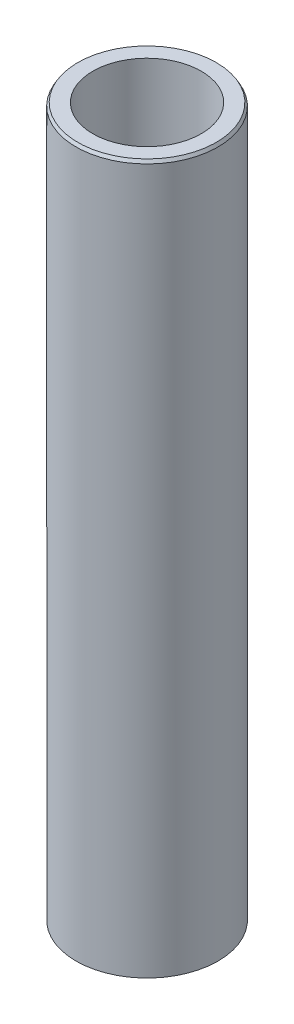
ISO-10303-21;
HEADER;
FILE_DESCRIPTION(('STEP AP214'),'2;1');
FILE_NAME('part.step','',(''),(''),'','','');
FILE_SCHEMA(('AUTOMOTIVE_DESIGN { 1 0 10303 214 1 1 1 1 }'));
ENDSEC;
DATA;
#1=APPLICATION_CONTEXT('core data for automotive mechanical design processes');
#2=APPLICATION_PROTOCOL_DEFINITION('international standard','automotive_design',2000,#1);
#3=PRODUCT_CONTEXT('',#1,'mechanical');
#4=PRODUCT('Part','Part','',(#3));
#5=PRODUCT_RELATED_PRODUCT_CATEGORY('part','',(#4));
#6=PRODUCT_DEFINITION_FORMATION('','',#4);
#7=PRODUCT_DEFINITION_CONTEXT('part definition',#1,'design');
#8=PRODUCT_DEFINITION('design','',#6,#7);
#9=PRODUCT_DEFINITION_SHAPE('','',#8);
#10=(LENGTH_UNIT() NAMED_UNIT(*) SI_UNIT(.MILLI.,.METRE.));
#11=(NAMED_UNIT(*) PLANE_ANGLE_UNIT() SI_UNIT($,.RADIAN.));
#12=(NAMED_UNIT(*) SI_UNIT($,.STERADIAN.) SOLID_ANGLE_UNIT());
#13=UNCERTAINTY_MEASURE_WITH_UNIT(LENGTH_MEASURE(1.E-05),#10,'distance_accuracy_value','');
#14=(GEOMETRIC_REPRESENTATION_CONTEXT(3) GLOBAL_UNCERTAINTY_ASSIGNED_CONTEXT((#13)) GLOBAL_UNIT_ASSIGNED_CONTEXT((#10,
#11,#12)) REPRESENTATION_CONTEXT('',''));
#15=CARTESIAN_POINT('',(0.,0.,0.));
#16=DIRECTION('',(0.,0.,1.));
#17=DIRECTION('',(1.,0.,0.));
#18=AXIS2_PLACEMENT_3D('',#15,#16,#17);
#19=CARTESIAN_POINT('',(0.,600.,0.));
#20=DIRECTION('',(0.,-1.,0.));
#21=DIRECTION('',(0.,0.,-1.));
#22=AXIS2_PLACEMENT_3D('',#19,#20,#21);
#23=CYLINDRICAL_SURFACE('',#22,60.);
#24=CARTESIAN_POINT('',(0.,597.395240626448,0.));
#25=DIRECTION('',(0.,1.,0.));
#26=DIRECTION('',(0.,0.,1.));
#27=AXIS2_PLACEMENT_3D('',#24,#25,#26);
#28=CIRCLE('',#27,60.);
#29=CARTESIAN_POINT('',(0.,597.395240626448,-60.));
#30=VERTEX_POINT('',#29);
#31=EDGE_CURVE('E50',#30,#30,#28,.F.);
#32=ORIENTED_EDGE('',*,*,#31,.T.);
#33=EDGE_LOOP('',(#32));
#34=FACE_BOUND('',#33,.T.);
#35=CARTESIAN_POINT('',(0.,1.50385852549417,0.));
#36=DIRECTION('',(0.,1.,0.));
#37=DIRECTION('',(0.,0.,1.));
#38=AXIS2_PLACEMENT_3D('',#35,#36,#37);
#39=CIRCLE('',#38,60.);
#40=CARTESIAN_POINT('',(0.,1.50385852549417,60.));
#41=VERTEX_POINT('',#40);
#42=EDGE_CURVE('E51',#41,#41,#39,.T.);
#43=ORIENTED_EDGE('',*,*,#42,.T.);
#44=EDGE_LOOP('',(#43));
#45=FACE_BOUND('',#44,.T.);
#46=ADVANCED_FACE('F39',(#34,#45),#23,.T.);
#47=CARTESIAN_POINT('',(0.,600.,0.));
#48=DIRECTION('',(0.,1.,0.));
#49=DIRECTION('',(0.,0.,1.));
#50=AXIS2_PLACEMENT_3D('',#47,#48,#49);
#51=PLANE('',#50);
#52=CARTESIAN_POINT('',(0.,600.,0.));
#53=DIRECTION('',(0.,1.,0.));
#54=DIRECTION('',(0.,0.,1.));
#55=AXIS2_PLACEMENT_3D('',#52,#53,#54);
#56=CIRCLE('',#55,58.4961414745057);
#57=CARTESIAN_POINT('',(0.,600.,-58.4961414745057));
#58=VERTEX_POINT('',#57);
#59=EDGE_CURVE('E54',#58,#58,#56,.T.);
#60=ORIENTED_EDGE('',*,*,#59,.T.);
#61=EDGE_LOOP('',(#60));
#62=FACE_BOUND('',#61,.T.);
#63=CARTESIAN_POINT('',(0.,600.,0.));
#64=DIRECTION('',(0.,1.,0.));
#65=DIRECTION('',(0.,0.,1.));
#66=AXIS2_PLACEMENT_3D('',#63,#64,#65);
#67=CIRCLE('',#66,45.8300366291247);
#68=CARTESIAN_POINT('',(0.,600.,45.8300366291247));
#69=VERTEX_POINT('',#68);
#70=EDGE_CURVE('E58',#69,#69,#67,.T.);
#71=ORIENTED_EDGE('',*,*,#70,.F.);
#72=EDGE_LOOP('',(#71));
#73=FACE_BOUND('',#72,.T.);
#74=ADVANCED_FACE('F69',(#62,#73),#51,.T.);
#75=CARTESIAN_POINT('',(0.,0.,0.));
#76=DIRECTION('',(0.,1.,0.));
#77=DIRECTION('',(0.,0.,1.));
#78=AXIS2_PLACEMENT_3D('',#75,#76,#77);
#79=PLANE('',#78);
#80=CARTESIAN_POINT('',(0.,0.,0.));
#81=DIRECTION('',(0.,1.,0.));
#82=DIRECTION('',(0.,0.,1.));
#83=AXIS2_PLACEMENT_3D('',#80,#81,#82);
#84=CIRCLE('',#83,57.3952406264484);
#85=CARTESIAN_POINT('',(0.,0.,57.3952406264484));
#86=VERTEX_POINT('',#85);
#87=EDGE_CURVE('E10',#86,#86,#84,.F.);
#88=ORIENTED_EDGE('',*,*,#87,.T.);
#89=EDGE_LOOP('',(#88));
#90=FACE_BOUND('',#89,.T.);
#91=CARTESIAN_POINT('',(0.,0.,0.));
#92=DIRECTION('',(0.,1.,0.));
#93=DIRECTION('',(0.,0.,1.));
#94=AXIS2_PLACEMENT_3D('',#91,#92,#93);
#95=CIRCLE('',#94,45.8300366291247);
#96=CARTESIAN_POINT('',(0.,0.,45.8300366291247));
#97=VERTEX_POINT('',#96);
#98=EDGE_CURVE('E63',#97,#97,#95,.T.);
#99=ORIENTED_EDGE('',*,*,#98,.T.);
#100=EDGE_LOOP('',(#99));
#101=FACE_BOUND('',#100,.T.);
#102=ADVANCED_FACE('F75',(#90,#101),#79,.F.);
#103=CARTESIAN_POINT('',(0.,600.,0.));
#104=DIRECTION('',(0.,-1.,0.));
#105=DIRECTION('',(0.,0.,-1.));
#106=AXIS2_PLACEMENT_3D('',#103,#104,#105);
#107=CYLINDRICAL_SURFACE('',#106,45.8300366291247);
#108=ORIENTED_EDGE('',*,*,#70,.T.);
#109=EDGE_LOOP('',(#108));
#110=FACE_BOUND('',#109,.T.);
#111=ORIENTED_EDGE('',*,*,#98,.F.);
#112=EDGE_LOOP('',(#111));
#113=FACE_BOUND('',#112,.T.);
#114=ADVANCED_FACE('F70',(#110,#113),#107,.F.);
#115=CARTESIAN_POINT('',(0.,600.,0.));
#116=DIRECTION('',(0.,-1.,0.));
#117=DIRECTION('',(0.,0.,-1.));
#118=AXIS2_PLACEMENT_3D('',#115,#116,#117);
#119=CONICAL_SURFACE('',#118,58.4961414745057,0.523598775598308);
#120=CARTESIAN_POINT('',(0.,597.395240626448,-60.));
#121=CARTESIAN_POINT('',(0.,597.422373536589,-59.9843348070262));
#122=CARTESIAN_POINT('',(0.,597.44950644673,-59.9686696140522));
#123=CARTESIAN_POINT('',(0.,597.503772267013,-59.9373392281044));
#124=CARTESIAN_POINT('',(0.,597.530905177154,-59.9216740351305));
#125=CARTESIAN_POINT('',(0.,597.585170997436,-59.8903436491827));
#126=CARTESIAN_POINT('',(0.,597.612303907577,-59.8746784562088));
#127=CARTESIAN_POINT('',(0.,597.66656972786,-59.8433480702611));
#128=CARTESIAN_POINT('',(0.,597.693702638001,-59.8276828772871));
#129=CARTESIAN_POINT('',(0.,597.747968458283,-59.7963524913393));
#130=CARTESIAN_POINT('',(0.,597.775101368425,-59.7806872983654));
#131=CARTESIAN_POINT('',(0.,597.829367188707,-59.7493569124176));
#132=CARTESIAN_POINT('',(0.,597.856500098848,-59.7336917194437));
#133=CARTESIAN_POINT('',(0.,597.91076591913,-59.702361333496));
#134=CARTESIAN_POINT('',(0.,597.937898829271,-59.6866961405221));
#135=CARTESIAN_POINT('',(0.,597.992164649554,-59.6553657545742));
#136=CARTESIAN_POINT('',(0.,598.019297559695,-59.6397005616003));
#137=CARTESIAN_POINT('',(0.,598.073563379977,-59.6083701756525));
#138=CARTESIAN_POINT('',(0.,598.100696290118,-59.5927049826786));
#139=CARTESIAN_POINT('',(0.,598.154962110401,-59.5613745967309));
#140=CARTESIAN_POINT('',(0.,598.182095020542,-59.545709403757));
#141=CARTESIAN_POINT('',(0.,598.236360840824,-59.5143790178091));
#142=CARTESIAN_POINT('',(0.,598.263493750965,-59.4987138248352));
#143=CARTESIAN_POINT('',(0.,598.317759571248,-59.4673834388874));
#144=CARTESIAN_POINT('',(0.,598.344892481389,-59.4517182459136));
#145=CARTESIAN_POINT('',(0.,598.399158301671,-59.4203878599658));
#146=CARTESIAN_POINT('',(0.,598.426291211812,-59.4047226669919));
#147=CARTESIAN_POINT('',(0.,598.480557032095,-59.373392281044));
#148=CARTESIAN_POINT('',(0.,598.507689942236,-59.3577270880701));
#149=CARTESIAN_POINT('',(0.,598.561955762518,-59.3263967021224));
#150=CARTESIAN_POINT('',(0.,598.589088672659,-59.3107315091485));
#151=CARTESIAN_POINT('',(0.,598.643354492942,-59.2794011232007));
#152=CARTESIAN_POINT('',(0.,598.670487403083,-59.2637359302268));
#153=CARTESIAN_POINT('',(0.,598.724753223365,-59.232405544279));
#154=CARTESIAN_POINT('',(0.,598.751886133506,-59.216740351305));
#155=CARTESIAN_POINT('',(0.,598.806151953789,-59.1854099653573));
#156=CARTESIAN_POINT('',(0.,598.83328486393,-59.1697447723834));
#157=CARTESIAN_POINT('',(0.,598.887550684212,-59.1384143864356));
#158=CARTESIAN_POINT('',(0.,598.914683594353,-59.1227491934617));
#159=CARTESIAN_POINT('',(0.,598.968949414636,-59.0914188075139));
#160=CARTESIAN_POINT('',(0.,598.996082324777,-59.07575361454));
#161=CARTESIAN_POINT('',(0.,599.050348145059,-59.0444232285922));
#162=CARTESIAN_POINT('',(0.,599.0774810552,-59.0287580356183));
#163=CARTESIAN_POINT('',(0.,599.131746875483,-58.9974276496705));
#164=CARTESIAN_POINT('',(0.,599.158879785624,-58.9817624566966));
#165=CARTESIAN_POINT('',(0.,599.213145605906,-58.9504320707488));
#166=CARTESIAN_POINT('',(0.,599.240278516047,-58.9347668777749));
#167=CARTESIAN_POINT('',(0.,599.29454433633,-58.9034364918271));
#168=CARTESIAN_POINT('',(0.,599.321677246471,-58.8877712988532));
#169=CARTESIAN_POINT('',(0.,599.375943066753,-58.8564409129054));
#170=CARTESIAN_POINT('',(0.,599.403075976894,-58.8407757199315));
#171=CARTESIAN_POINT('',(0.,599.457341797177,-58.8094453339837));
#172=CARTESIAN_POINT('',(0.,599.484474707318,-58.7937801410098));
#173=CARTESIAN_POINT('',(0.,599.5387405276,-58.762449755062));
#174=CARTESIAN_POINT('',(0.,599.565873437741,-58.7467845620881));
#175=CARTESIAN_POINT('',(0.,599.620139258024,-58.7154541761403));
#176=CARTESIAN_POINT('',(0.,599.647272168165,-58.6997889831664));
#177=CARTESIAN_POINT('',(0.,599.701537988447,-58.6684585972186));
#178=CARTESIAN_POINT('',(0.,599.728670898588,-58.6527934042447));
#179=CARTESIAN_POINT('',(0.,599.782936718871,-58.6214630182969));
#180=CARTESIAN_POINT('',(0.,599.810069629012,-58.605797825323));
#181=CARTESIAN_POINT('',(0.,599.864335449294,-58.5744674393752));
#182=CARTESIAN_POINT('',(0.,599.891468359435,-58.5588022464013));
#183=CARTESIAN_POINT('',(0.,599.945734179718,-58.5274718604535));
#184=CARTESIAN_POINT('',(0.,599.972867089859,-58.5118066674796));
#185=CARTESIAN_POINT('',(0.,600.,-58.4961414745057));
#186=B_SPLINE_CURVE_WITH_KNOTS('',3,(#120,#121,#122,#123,#124,#125,#126,#127,#128,#129,#130,
#131,#132,#133,#134,#135,#136,#137,#138,#139,#140,#141,#142,#143,#144,#145,#146,#147,#148,#149,
#150,#151,#152,#153,#154,#155,#156,#157,#158,#159,#160,#161,#162,#163,#164,#165,#166,#167,#168,
#169,#170,#171,#172,#173,#174,#175,#176,#177,#178,#179,#180,#181,#182,#183,#184,#185),
.UNSPECIFIED.,.F.,.F.,(4,2,2,2,2,2,2,2,2,2,2,2,2,2,2,2,2,2,2,2,2,2,2,2,2,2,2,2,2,2,2,2,4),(0.,
0.0939911578434604,0.187982315686821,0.281973473530278,0.375964631373639,0.469955789217003,
0.56394694706046,0.657938104903821,0.751929262747182,0.845920420590642,0.939911578434003,
1.03390273627736,1.12789389412082,1.22188505196419,1.31587620980755,1.409867367651,
1.50385852549436,1.59784968333773,1.69184084118119,1.78583199902455,1.87982315686791,
1.97381431471137,2.06780547255473,2.16179663039809,2.25578778824155,2.34977894608491,
2.44377010392827,2.53776126177173,2.63175241961509,2.72574357745845,2.81973473530191,
2.91372589314527,3.00771705098873),.UNSPECIFIED.);
#187=EDGE_CURVE('BSEAM81',#30,#58,#186,.T.);
#188=ORIENTED_EDGE('',*,*,#31,.F.);
#189=ORIENTED_EDGE('',*,*,#59,.F.);
#190=ORIENTED_EDGE('',*,*,#187,.T.);
#191=ORIENTED_EDGE('',*,*,#187,.F.);
#192=EDGE_LOOP('',(#188,#190,#189,#191));
#193=FACE_BOUND('',#192,.T.);
#194=ADVANCED_FACE('F81',(#193),#119,.T.);
#195=CARTESIAN_POINT('',(0.,1.50385852549417,0.));
#196=DIRECTION('',(0.,1.,0.));
#197=DIRECTION('',(0.,0.,1.));
#198=AXIS2_PLACEMENT_3D('',#195,#196,#197);
#199=CONICAL_SURFACE('',#198,60.,1.04719755119661);
#200=ORIENTED_EDGE('',*,*,#87,.F.);
#201=EDGE_LOOP('',(#200));
#202=FACE_BOUND('',#201,.T.);
#203=ORIENTED_EDGE('',*,*,#42,.F.);
#204=EDGE_LOOP('',(#203));
#205=FACE_BOUND('',#204,.T.);
#206=ADVANCED_FACE('F45',(#202,#205),#199,.T.);
#207=CLOSED_SHELL('',(#46,#74,#102,#114,#194,#206));
#208=MANIFOLD_SOLID_BREP('B2',#207);
#209=ADVANCED_BREP_SHAPE_REPRESENTATION('',(#18,#208),#14);
#210=SHAPE_DEFINITION_REPRESENTATION(#9,#209);
ENDSEC;
END-ISO-10303-21;
